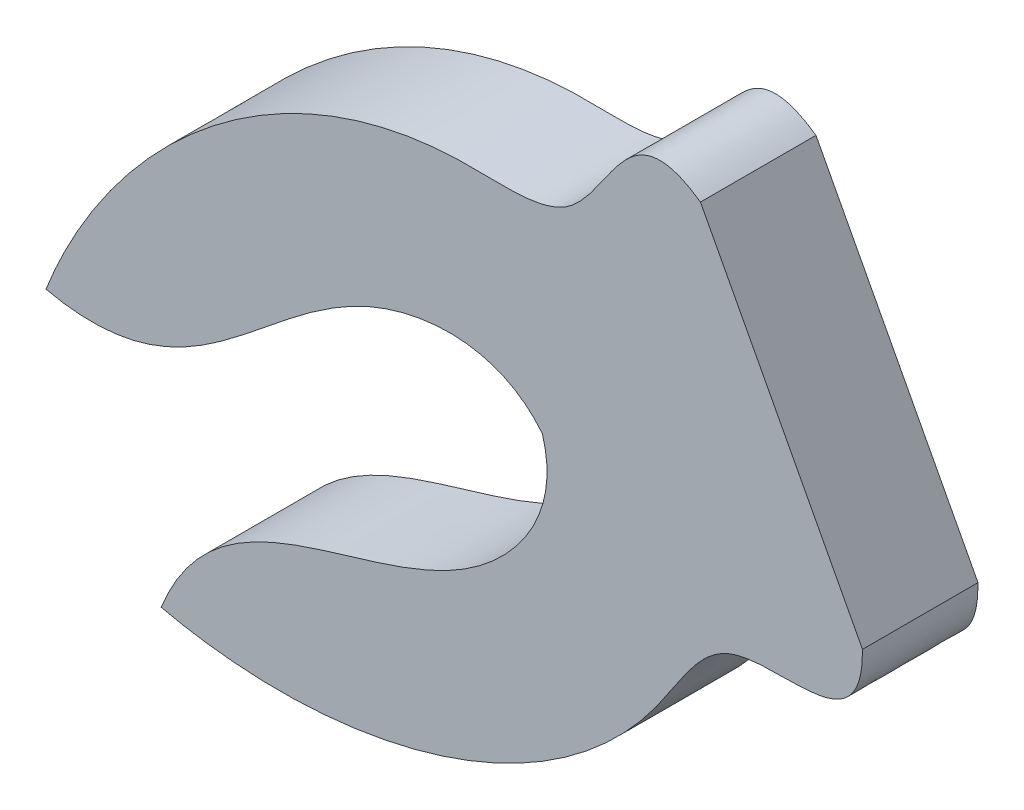
ISO-10303-21;
HEADER;
FILE_DESCRIPTION(('STEP AP214'),'2;1');
FILE_NAME('part.step','',(''),(''),'','','');
FILE_SCHEMA(('AUTOMOTIVE_DESIGN { 1 0 10303 214 1 1 1 1 }'));
ENDSEC;
DATA;
#1=APPLICATION_CONTEXT('core data for automotive mechanical design processes');
#2=APPLICATION_PROTOCOL_DEFINITION('international standard','automotive_design',2000,#1);
#3=PRODUCT_CONTEXT('',#1,'mechanical');
#4=PRODUCT('Part','Part','',(#3));
#5=PRODUCT_RELATED_PRODUCT_CATEGORY('part','',(#4));
#6=PRODUCT_DEFINITION_FORMATION('','',#4);
#7=PRODUCT_DEFINITION_CONTEXT('part definition',#1,'design');
#8=PRODUCT_DEFINITION('design','',#6,#7);
#9=PRODUCT_DEFINITION_SHAPE('','',#8);
#10=(LENGTH_UNIT() NAMED_UNIT(*) SI_UNIT(.MILLI.,.METRE.));
#11=(NAMED_UNIT(*) PLANE_ANGLE_UNIT() SI_UNIT($,.RADIAN.));
#12=(NAMED_UNIT(*) SI_UNIT($,.STERADIAN.) SOLID_ANGLE_UNIT());
#13=UNCERTAINTY_MEASURE_WITH_UNIT(LENGTH_MEASURE(1.E-05),#10,'distance_accuracy_value','');
#14=(GEOMETRIC_REPRESENTATION_CONTEXT(3) GLOBAL_UNCERTAINTY_ASSIGNED_CONTEXT((#13)) GLOBAL_UNIT_ASSIGNED_CONTEXT((#10,
#11,#12)) REPRESENTATION_CONTEXT('',''));
#15=CARTESIAN_POINT('',(0.,0.,0.));
#16=DIRECTION('',(0.,0.,1.));
#17=DIRECTION('',(1.,0.,0.));
#18=AXIS2_PLACEMENT_3D('',#15,#16,#17);
#19=CARTESIAN_POINT('',(184.17090121328,171.164436770007,3.175));
#20=CARTESIAN_POINT('',(182.120543743082,172.608990098127,3.175));
#21=CARTESIAN_POINT('',(181.497879866043,168.504073672287,3.175));
#22=CARTESIAN_POINT('',(173.198417298502,169.574233049101,3.175));
#23=CARTESIAN_POINT('',(167.947769761185,164.61471818866,3.175));
#24=CARTESIAN_POINT('',(166.183974101424,160.095060854953,3.175));
#25=B_SPLINE_CURVE_WITH_KNOTS('',3,(#19,#20,#21,#22,#23,#24),.UNSPECIFIED.,.F.,.F.,(4,1,1,4),
(0.,0.207300480944505,0.334319205083723,1.),.UNSPECIFIED.);
#26=DIRECTION('',(0.,0.,-1.));
#27=VECTOR('',#26,1.);
#28=SURFACE_OF_LINEAR_EXTRUSION('',#25,#27);
#29=CARTESIAN_POINT('',(184.17090121328,171.164436770007,0.));
#30=CARTESIAN_POINT('',(182.120543743082,172.608990098127,0.));
#31=CARTESIAN_POINT('',(181.497879866043,168.504073672287,0.));
#32=CARTESIAN_POINT('',(173.198417298502,169.574233049101,0.));
#33=CARTESIAN_POINT('',(167.947769761185,164.61471818866,0.));
#34=CARTESIAN_POINT('',(166.183974101424,160.095060854953,0.));
#35=B_SPLINE_CURVE_WITH_KNOTS('',3,(#29,#30,#31,#32,#33,#34),.UNSPECIFIED.,.F.,.F.,(4,1,1,4),
(0.,0.207300480944505,0.334319205083723,1.),.UNSPECIFIED.);
#36=CARTESIAN_POINT('',(184.17090121328,171.164436770007,0.));
#37=VERTEX_POINT('',#36);
#38=CARTESIAN_POINT('',(166.183974101424,160.095060854953,0.));
#39=VERTEX_POINT('',#38);
#40=EDGE_CURVE('E153',#37,#39,#35,.T.);
#41=ORIENTED_EDGE('',*,*,#40,.T.);
#42=DIRECTION('',(0.,0.,-1.));
#43=VECTOR('',#42,1.);
#44=CARTESIAN_POINT('',(166.183974101424,160.095060854953,3.175));
#45=LINE('',#44,#43);
#46=CARTESIAN_POINT('',(166.183974101424,160.095060854953,3.175));
#47=VERTEX_POINT('',#46);
#48=EDGE_CURVE('E11',#47,#39,#45,.T.);
#49=ORIENTED_EDGE('',*,*,#48,.F.);
#50=CARTESIAN_POINT('',(184.17090121328,171.164436770007,3.175));
#51=VERTEX_POINT('',#50);
#52=EDGE_CURVE('E129',#51,#47,#25,.T.);
#53=ORIENTED_EDGE('',*,*,#52,.F.);
#54=DIRECTION('',(0.,0.,-1.));
#55=VECTOR('',#54,1.);
#56=CARTESIAN_POINT('',(184.17090121328,171.164436770007,3.175));
#57=LINE('',#56,#55);
#58=EDGE_CURVE('E50',#51,#37,#57,.T.);
#59=ORIENTED_EDGE('',*,*,#58,.T.);
#60=EDGE_LOOP('',(#41,#49,#53,#59));
#61=FACE_BOUND('',#60,.T.);
#62=ADVANCED_FACE('F33',(#61),#28,.F.);
#63=CARTESIAN_POINT('',(166.183974101424,160.095060854953,3.175));
#64=CARTESIAN_POINT('',(170.38657504769,159.15805489335,3.175));
#65=CARTESIAN_POINT('',(172.870574030314,164.793727954221,3.175));
#66=CARTESIAN_POINT('',(178.745458809592,164.825710962978,3.175));
#67=CARTESIAN_POINT('',(179.826186230609,163.47927452496,3.175));
#68=B_SPLINE_CURVE_WITH_KNOTS('',3,(#63,#64,#65,#66,#67),.UNSPECIFIED.,.F.,.F.,(4,1,4),(0.,
0.681893717361878,1.),.UNSPECIFIED.);
#69=DIRECTION('',(0.,0.,-1.));
#70=VECTOR('',#69,1.);
#71=SURFACE_OF_LINEAR_EXTRUSION('',#68,#70);
#72=CARTESIAN_POINT('',(166.183974101424,160.095060854953,0.));
#73=CARTESIAN_POINT('',(170.38657504769,159.15805489335,0.));
#74=CARTESIAN_POINT('',(172.870574030314,164.793727954221,0.));
#75=CARTESIAN_POINT('',(178.745458809592,164.825710962978,0.));
#76=CARTESIAN_POINT('',(179.826186230609,163.47927452496,0.));
#77=B_SPLINE_CURVE_WITH_KNOTS('',3,(#72,#73,#74,#75,#76),.UNSPECIFIED.,.F.,.F.,(4,1,4),(0.,
0.681893717361878,1.),.UNSPECIFIED.);
#78=CARTESIAN_POINT('',(179.826186230609,163.47927452496,0.));
#79=VERTEX_POINT('',#78);
#80=EDGE_CURVE('E152',#39,#79,#77,.T.);
#81=ORIENTED_EDGE('',*,*,#80,.T.);
#82=DIRECTION('',(0.,0.,-1.));
#83=VECTOR('',#82,1.);
#84=CARTESIAN_POINT('',(179.826186230609,163.47927452496,3.175));
#85=LINE('',#84,#83);
#86=CARTESIAN_POINT('',(179.826186230609,163.47927452496,3.175));
#87=VERTEX_POINT('',#86);
#88=EDGE_CURVE('E42',#87,#79,#85,.T.);
#89=ORIENTED_EDGE('',*,*,#88,.F.);
#90=EDGE_CURVE('E79',#47,#87,#68,.T.);
#91=ORIENTED_EDGE('',*,*,#90,.F.);
#92=ORIENTED_EDGE('',*,*,#48,.T.);
#93=EDGE_LOOP('',(#81,#89,#91,#92));
#94=FACE_BOUND('',#93,.T.);
#95=ADVANCED_FACE('F124',(#94),#71,.F.);
#96=CARTESIAN_POINT('',(169.349928800991,154.108528332137,3.175));
#97=CARTESIAN_POINT('',(170.941079423895,158.109537527435,3.175));
#98=CARTESIAN_POINT('',(176.997356852548,156.990356799452,3.175));
#99=CARTESIAN_POINT('',(180.330722428412,161.828121574664,3.175));
#100=CARTESIAN_POINT('',(179.826186230609,163.47927452496,3.175));
#101=B_SPLINE_CURVE_WITH_KNOTS('',3,(#96,#97,#98,#99,#100),.UNSPECIFIED.,.F.,.F.,(4,1,4),(0.,
0.681893717361877,1.),.UNSPECIFIED.);
#102=DIRECTION('',(0.,0.,-1.));
#103=VECTOR('',#102,1.);
#104=SURFACE_OF_LINEAR_EXTRUSION('',#101,#103);
#105=CARTESIAN_POINT('',(169.349928800991,154.108528332137,0.));
#106=CARTESIAN_POINT('',(170.941079423895,158.109537527435,0.));
#107=CARTESIAN_POINT('',(176.997356852548,156.990356799452,0.));
#108=CARTESIAN_POINT('',(180.330722428412,161.828121574664,0.));
#109=CARTESIAN_POINT('',(179.826186230609,163.47927452496,0.));
#110=B_SPLINE_CURVE_WITH_KNOTS('',3,(#105,#106,#107,#108,#109),.UNSPECIFIED.,.F.,.F.,(4,1,4),
(0.,0.681893717361877,1.),.UNSPECIFIED.);
#111=CARTESIAN_POINT('',(169.349928800991,154.108528332137,0.));
#112=VERTEX_POINT('',#111);
#113=EDGE_CURVE('E91',#112,#79,#110,.T.);
#114=ORIENTED_EDGE('',*,*,#113,.F.);
#115=DIRECTION('',(0.,0.,-1.));
#116=VECTOR('',#115,1.);
#117=CARTESIAN_POINT('',(169.349928800991,154.108528332137,3.175));
#118=LINE('',#117,#116);
#119=CARTESIAN_POINT('',(169.349928800991,154.108528332137,3.175));
#120=VERTEX_POINT('',#119);
#121=EDGE_CURVE('E86',#120,#112,#118,.T.);
#122=ORIENTED_EDGE('',*,*,#121,.F.);
#123=EDGE_CURVE('E89',#120,#87,#101,.T.);
#124=ORIENTED_EDGE('',*,*,#123,.T.);
#125=ORIENTED_EDGE('',*,*,#88,.T.);
#126=EDGE_LOOP('',(#114,#122,#124,#125));
#127=FACE_BOUND('',#126,.T.);
#128=ADVANCED_FACE('F88',(#127),#104,.T.);
#129=CARTESIAN_POINT('',(188.623811439289,162.744388342646,3.175));
#130=CARTESIAN_POINT('',(188.66364635175,160.236577892646,3.175));
#131=CARTESIAN_POINT('',(184.920317244198,162.032555720866,3.175));
#132=CARTESIAN_POINT('',(181.133127764178,154.570416895822,3.175));
#133=CARTESIAN_POINT('',(174.07838858589,153.022275320126,3.175));
#134=CARTESIAN_POINT('',(169.349928800991,154.108528332137,3.175));
#135=B_SPLINE_CURVE_WITH_KNOTS('',3,(#129,#130,#131,#132,#133,#134),.UNSPECIFIED.,.F.,.F.,(4,1,
1,4),(0.,0.207300480944506,0.334319205083723,1.),.UNSPECIFIED.);
#136=DIRECTION('',(0.,0.,-1.));
#137=VECTOR('',#136,1.);
#138=SURFACE_OF_LINEAR_EXTRUSION('',#135,#137);
#139=CARTESIAN_POINT('',(188.623811439289,162.744388342646,0.));
#140=CARTESIAN_POINT('',(188.66364635175,160.236577892646,0.));
#141=CARTESIAN_POINT('',(184.920317244198,162.032555720866,0.));
#142=CARTESIAN_POINT('',(181.133127764178,154.570416895822,0.));
#143=CARTESIAN_POINT('',(174.07838858589,153.022275320126,0.));
#144=CARTESIAN_POINT('',(169.349928800991,154.108528332137,0.));
#145=B_SPLINE_CURVE_WITH_KNOTS('',3,(#139,#140,#141,#142,#143,#144),.UNSPECIFIED.,.F.,.F.,(4,1,
1,4),(0.,0.207300480944506,0.334319205083723,1.),.UNSPECIFIED.);
#146=CARTESIAN_POINT('',(188.623811439289,162.744388342646,0.));
#147=VERTEX_POINT('',#146);
#148=EDGE_CURVE('E142',#147,#112,#145,.T.);
#149=ORIENTED_EDGE('',*,*,#148,.F.);
#150=DIRECTION('',(0.,0.,-1.));
#151=VECTOR('',#150,1.);
#152=CARTESIAN_POINT('',(188.623811439289,162.744388342646,3.175));
#153=LINE('',#152,#151);
#154=CARTESIAN_POINT('',(188.623811439289,162.744388342646,3.175));
#155=VERTEX_POINT('',#154);
#156=EDGE_CURVE('E67',#155,#147,#153,.T.);
#157=ORIENTED_EDGE('',*,*,#156,.F.);
#158=EDGE_CURVE('E100',#155,#120,#135,.T.);
#159=ORIENTED_EDGE('',*,*,#158,.T.);
#160=ORIENTED_EDGE('',*,*,#121,.T.);
#161=EDGE_LOOP('',(#149,#157,#159,#160));
#162=FACE_BOUND('',#161,.T.);
#163=ADVANCED_FACE('F102',(#162),#138,.T.);
#164=CARTESIAN_POINT('',(184.17090121328,171.164436770007,3.175));
#165=DIRECTION('',(0.883994585549742,0.467497136588814,0.));
#166=DIRECTION('',(-0.467497136588814,0.883994585549742,0.));
#167=AXIS2_PLACEMENT_3D('',#164,#165,#166);
#168=PLANE('',#167);
#169=DIRECTION('',(0.467497136588814,-0.883994585549742,0.));
#170=VECTOR('',#169,1.);
#171=CARTESIAN_POINT('',(184.17090121328,171.164436770007,0.));
#172=LINE('',#171,#170);
#173=EDGE_CURVE('E136',#37,#147,#172,.T.);
#174=ORIENTED_EDGE('',*,*,#173,.F.);
#175=ORIENTED_EDGE('',*,*,#58,.F.);
#176=DIRECTION('',(0.467497136588814,-0.883994585549742,0.));
#177=VECTOR('',#176,1.);
#178=CARTESIAN_POINT('',(184.17090121328,171.164436770007,3.175));
#179=LINE('',#178,#177);
#180=EDGE_CURVE('E103',#51,#155,#179,.T.);
#181=ORIENTED_EDGE('',*,*,#180,.T.);
#182=ORIENTED_EDGE('',*,*,#156,.T.);
#183=EDGE_LOOP('',(#174,#175,#181,#182));
#184=FACE_BOUND('',#183,.T.);
#185=ADVANCED_FACE('F121',(#184),#168,.T.);
#186=CARTESIAN_POINT('',(173.91183145675,168.0935912642,3.175));
#187=DIRECTION('',(0.,0.,-1.));
#188=DIRECTION('',(-1.,0.,0.));
#189=AXIS2_PLACEMENT_3D('',#186,#187,#188);
#190=PLANE('',#189);
#191=ORIENTED_EDGE('',*,*,#52,.T.);
#192=ORIENTED_EDGE('',*,*,#90,.T.);
#193=ORIENTED_EDGE('',*,*,#123,.F.);
#194=ORIENTED_EDGE('',*,*,#158,.F.);
#195=ORIENTED_EDGE('',*,*,#180,.F.);
#196=EDGE_LOOP('',(#191,#192,#193,#194,#195));
#197=FACE_BOUND('',#196,.T.);
#198=ADVANCED_FACE('F98',(#197),#190,.F.);
#199=CARTESIAN_POINT('',(173.91183145675,168.0935912642,0.));
#200=DIRECTION('',(0.,0.,-1.));
#201=DIRECTION('',(-1.,0.,0.));
#202=AXIS2_PLACEMENT_3D('',#199,#200,#201);
#203=PLANE('',#202);
#204=ORIENTED_EDGE('',*,*,#40,.F.);
#205=ORIENTED_EDGE('',*,*,#173,.T.);
#206=ORIENTED_EDGE('',*,*,#148,.T.);
#207=ORIENTED_EDGE('',*,*,#113,.T.);
#208=ORIENTED_EDGE('',*,*,#80,.F.);
#209=EDGE_LOOP('',(#204,#205,#206,#207,#208));
#210=FACE_BOUND('',#209,.T.);
#211=ADVANCED_FACE('F155',(#210),#203,.T.);
#212=CLOSED_SHELL('',(#62,#95,#128,#163,#185,#198,#211));
#213=MANIFOLD_SOLID_BREP('B2',#212);
#214=ADVANCED_BREP_SHAPE_REPRESENTATION('',(#18,#213),#14);
#215=SHAPE_DEFINITION_REPRESENTATION(#9,#214);
ENDSEC;
END-ISO-10303-21;
